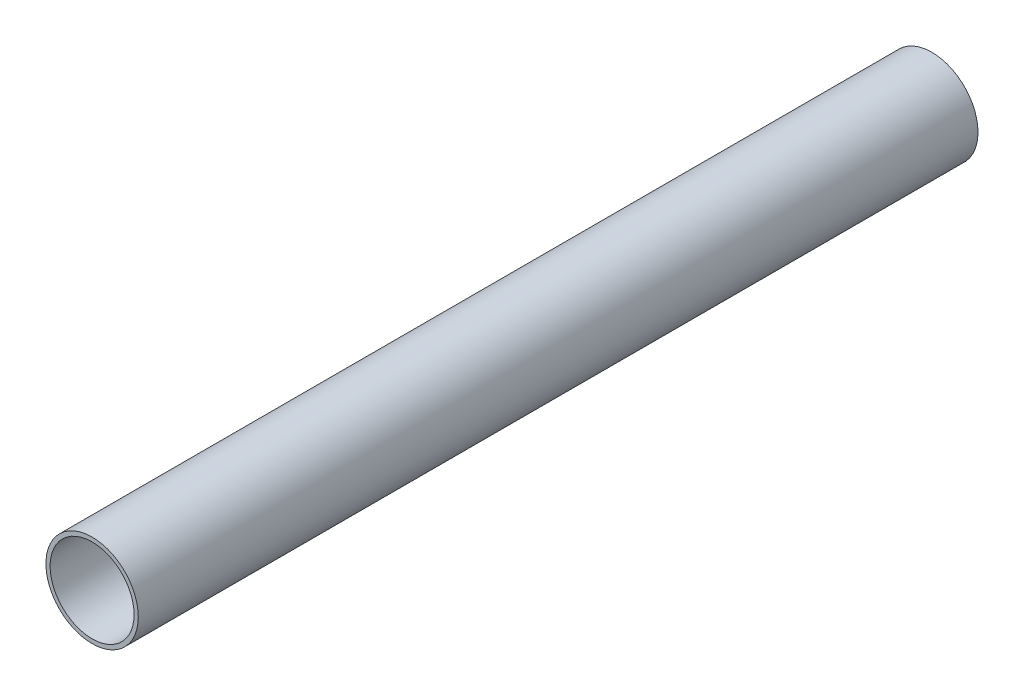
ISO-10303-21;
HEADER;
FILE_DESCRIPTION(('STEP AP214'),'2;1');
FILE_NAME('part.step','',(''),(''),'','','');
FILE_SCHEMA(('AUTOMOTIVE_DESIGN { 1 0 10303 214 1 1 1 1 }'));
ENDSEC;
DATA;
#1=APPLICATION_CONTEXT('core data for automotive mechanical design processes');
#2=APPLICATION_PROTOCOL_DEFINITION('international standard','automotive_design',2000,#1);
#3=PRODUCT_CONTEXT('',#1,'mechanical');
#4=PRODUCT('Part','Part','',(#3));
#5=PRODUCT_RELATED_PRODUCT_CATEGORY('part','',(#4));
#6=PRODUCT_DEFINITION_FORMATION('','',#4);
#7=PRODUCT_DEFINITION_CONTEXT('part definition',#1,'design');
#8=PRODUCT_DEFINITION('design','',#6,#7);
#9=PRODUCT_DEFINITION_SHAPE('','',#8);
#10=(LENGTH_UNIT() NAMED_UNIT(*) SI_UNIT(.MILLI.,.METRE.));
#11=(NAMED_UNIT(*) PLANE_ANGLE_UNIT() SI_UNIT($,.RADIAN.));
#12=(NAMED_UNIT(*) SI_UNIT($,.STERADIAN.) SOLID_ANGLE_UNIT());
#13=UNCERTAINTY_MEASURE_WITH_UNIT(LENGTH_MEASURE(1.E-05),#10,'distance_accuracy_value','');
#14=(GEOMETRIC_REPRESENTATION_CONTEXT(3) GLOBAL_UNCERTAINTY_ASSIGNED_CONTEXT((#13)) GLOBAL_UNIT_ASSIGNED_CONTEXT((#10,
#11,#12)) REPRESENTATION_CONTEXT('',''));
#15=CARTESIAN_POINT('',(0.,0.,0.));
#16=DIRECTION('',(0.,0.,1.));
#17=DIRECTION('',(1.,0.,0.));
#18=AXIS2_PLACEMENT_3D('',#15,#16,#17);
#19=CARTESIAN_POINT('',(0.,0.,30.));
#20=DIRECTION('',(0.,0.,1.));
#21=DIRECTION('',(1.,0.,0.));
#22=AXIS2_PLACEMENT_3D('',#19,#20,#21);
#23=PLANE('',#22);
#24=CARTESIAN_POINT('',(0.,0.,30.));
#25=DIRECTION('',(0.,0.,1.));
#26=DIRECTION('',(1.,0.,0.));
#27=AXIS2_PLACEMENT_3D('',#24,#25,#26);
#28=CIRCLE('',#27,1.65);
#29=CARTESIAN_POINT('',(1.65,0.,30.));
#30=VERTEX_POINT('',#29);
#31=EDGE_CURVE('E10',#30,#30,#28,.T.);
#32=ORIENTED_EDGE('',*,*,#31,.T.);
#33=EDGE_LOOP('',(#32));
#34=FACE_BOUND('',#33,.T.);
#35=CARTESIAN_POINT('',(0.,0.,30.));
#36=DIRECTION('',(0.,0.,1.));
#37=DIRECTION('',(1.,0.,0.));
#38=AXIS2_PLACEMENT_3D('',#35,#36,#37);
#39=CIRCLE('',#38,1.5);
#40=CARTESIAN_POINT('',(1.5,0.,30.));
#41=VERTEX_POINT('',#40);
#42=EDGE_CURVE('E35',#41,#41,#39,.T.);
#43=ORIENTED_EDGE('',*,*,#42,.F.);
#44=EDGE_LOOP('',(#43));
#45=FACE_BOUND('',#44,.T.);
#46=ADVANCED_FACE('F24',(#34,#45),#23,.T.);
#47=CARTESIAN_POINT('',(0.,0.,0.));
#48=DIRECTION('',(0.,0.,1.));
#49=DIRECTION('',(1.,0.,0.));
#50=AXIS2_PLACEMENT_3D('',#47,#48,#49);
#51=PLANE('',#50);
#52=CARTESIAN_POINT('',(0.,0.,0.));
#53=DIRECTION('',(0.,0.,1.));
#54=DIRECTION('',(1.,0.,0.));
#55=AXIS2_PLACEMENT_3D('',#52,#53,#54);
#56=CIRCLE('',#55,1.65);
#57=CARTESIAN_POINT('',(1.65,0.,0.));
#58=VERTEX_POINT('',#57);
#59=EDGE_CURVE('E31',#58,#58,#56,.T.);
#60=ORIENTED_EDGE('',*,*,#59,.F.);
#61=EDGE_LOOP('',(#60));
#62=FACE_BOUND('',#61,.T.);
#63=CARTESIAN_POINT('',(0.,0.,0.));
#64=DIRECTION('',(0.,0.,1.));
#65=DIRECTION('',(1.,0.,0.));
#66=AXIS2_PLACEMENT_3D('',#63,#64,#65);
#67=CIRCLE('',#66,1.5);
#68=CARTESIAN_POINT('',(1.5,0.,0.));
#69=VERTEX_POINT('',#68);
#70=EDGE_CURVE('E39',#69,#69,#67,.T.);
#71=ORIENTED_EDGE('',*,*,#70,.T.);
#72=EDGE_LOOP('',(#71));
#73=FACE_BOUND('',#72,.T.);
#74=ADVANCED_FACE('F45',(#62,#73),#51,.F.);
#75=CARTESIAN_POINT('',(0.,0.,30.));
#76=DIRECTION('',(0.,0.,-1.));
#77=DIRECTION('',(-1.,0.,0.));
#78=AXIS2_PLACEMENT_3D('',#75,#76,#77);
#79=CYLINDRICAL_SURFACE('',#78,1.65);
#80=ORIENTED_EDGE('',*,*,#31,.F.);
#81=EDGE_LOOP('',(#80));
#82=FACE_BOUND('',#81,.T.);
#83=ORIENTED_EDGE('',*,*,#59,.T.);
#84=EDGE_LOOP('',(#83));
#85=FACE_BOUND('',#84,.T.);
#86=ADVANCED_FACE('F26',(#82,#85),#79,.T.);
#87=CARTESIAN_POINT('',(0.,0.,30.));
#88=DIRECTION('',(0.,0.,-1.));
#89=DIRECTION('',(-1.,0.,0.));
#90=AXIS2_PLACEMENT_3D('',#87,#88,#89);
#91=CYLINDRICAL_SURFACE('',#90,1.5);
#92=ORIENTED_EDGE('',*,*,#42,.T.);
#93=EDGE_LOOP('',(#92));
#94=FACE_BOUND('',#93,.T.);
#95=ORIENTED_EDGE('',*,*,#70,.F.);
#96=EDGE_LOOP('',(#95));
#97=FACE_BOUND('',#96,.T.);
#98=ADVANCED_FACE('F47',(#94,#97),#91,.F.);
#99=CLOSED_SHELL('',(#46,#74,#86,#98));
#100=MANIFOLD_SOLID_BREP('B2',#99);
#101=ADVANCED_BREP_SHAPE_REPRESENTATION('',(#18,#100),#14);
#102=SHAPE_DEFINITION_REPRESENTATION(#9,#101);
ENDSEC;
END-ISO-10303-21;
